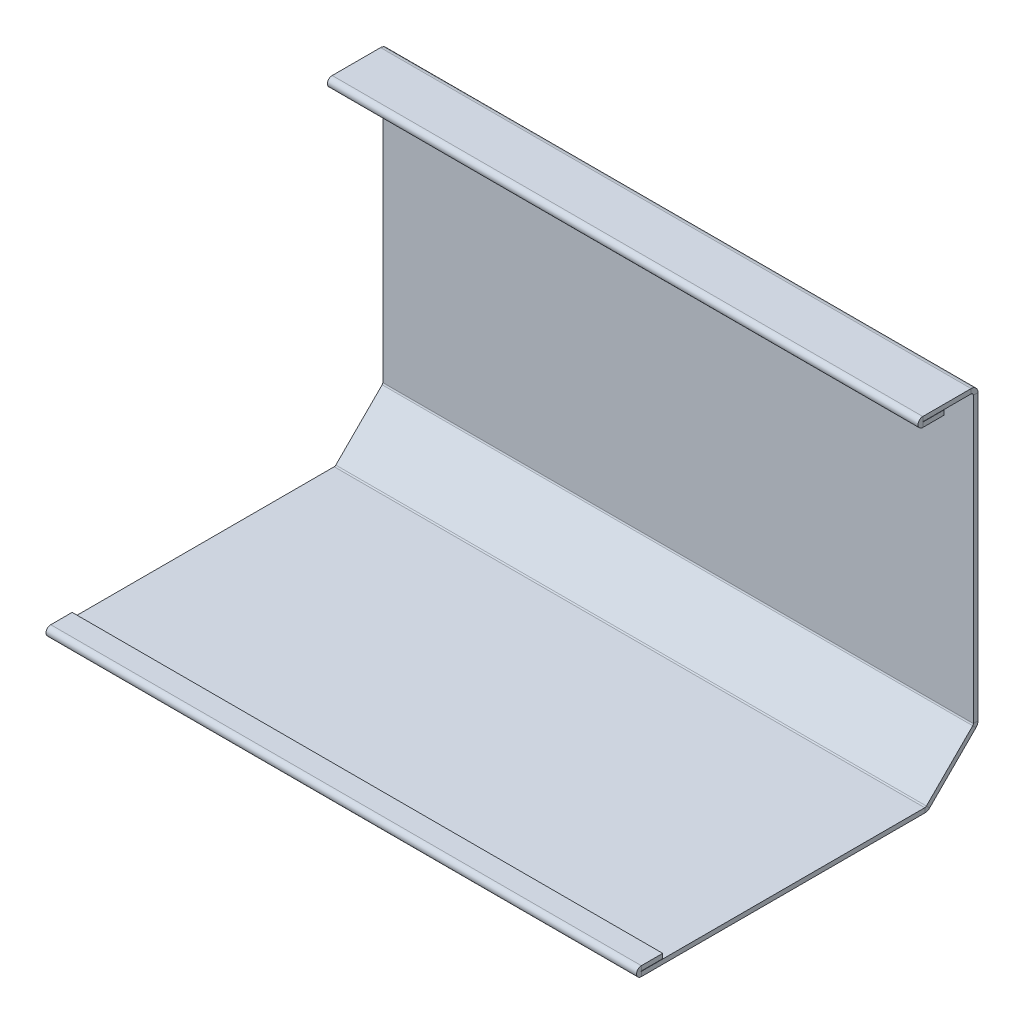
ISO-10303-21;
HEADER;
FILE_DESCRIPTION(('STEP AP214'),'2;1');
FILE_NAME('part.step','',(''),(''),'','','');
FILE_SCHEMA(('AUTOMOTIVE_DESIGN { 1 0 10303 214 1 1 1 1 }'));
ENDSEC;
DATA;
#1=APPLICATION_CONTEXT('core data for automotive mechanical design processes');
#2=APPLICATION_PROTOCOL_DEFINITION('international standard','automotive_design',2000,#1);
#3=PRODUCT_CONTEXT('',#1,'mechanical');
#4=PRODUCT('Part','Part','',(#3));
#5=PRODUCT_RELATED_PRODUCT_CATEGORY('part','',(#4));
#6=PRODUCT_DEFINITION_FORMATION('','',#4);
#7=PRODUCT_DEFINITION_CONTEXT('part definition',#1,'design');
#8=PRODUCT_DEFINITION('design','',#6,#7);
#9=PRODUCT_DEFINITION_SHAPE('','',#8);
#10=(LENGTH_UNIT() NAMED_UNIT(*) SI_UNIT(.MILLI.,.METRE.));
#11=(NAMED_UNIT(*) PLANE_ANGLE_UNIT() SI_UNIT($,.RADIAN.));
#12=(NAMED_UNIT(*) SI_UNIT($,.STERADIAN.) SOLID_ANGLE_UNIT());
#13=UNCERTAINTY_MEASURE_WITH_UNIT(LENGTH_MEASURE(1.E-05),#10,'distance_accuracy_value','');
#14=(GEOMETRIC_REPRESENTATION_CONTEXT(3) GLOBAL_UNCERTAINTY_ASSIGNED_CONTEXT((#13)) GLOBAL_UNIT_ASSIGNED_CONTEXT((#10,
#11,#12)) REPRESENTATION_CONTEXT('',''));
#15=CARTESIAN_POINT('',(0.,0.,0.));
#16=DIRECTION('',(0.,0.,1.));
#17=DIRECTION('',(1.,0.,0.));
#18=AXIS2_PLACEMENT_3D('',#15,#16,#17);
#19=CARTESIAN_POINT('',(-96.,111.97867965644,-64.0000000000011));
#20=DIRECTION('',(1.,0.,0.));
#21=DIRECTION('',(0.,0.,-1.));
#22=AXIS2_PLACEMENT_3D('',#19,#20,#21);
#23=PLANE('',#22);
#24=DIRECTION('',(0.,0.,-1.));
#25=VECTOR('',#24,1.);
#26=CARTESIAN_POINT('',(-96.,109.74207965644,-62.500000000001));
#27=LINE('',#26,#25);
#28=CARTESIAN_POINT('',(-96.,109.74207965644,-62.500000000001));
#29=VERTEX_POINT('',#28);
#30=CARTESIAN_POINT('',(-96.,109.74207965644,-64.000000000001));
#31=VERTEX_POINT('',#30);
#32=EDGE_CURVE('E368',#29,#31,#27,.T.);
#33=ORIENTED_EDGE('',*,*,#32,.T.);
#34=DIRECTION('',(0.,1.,0.));
#35=VECTOR('',#34,1.);
#36=CARTESIAN_POINT('',(-96.,-1.50000000000069,-63.9999999999999));
#37=LINE('',#36,#35);
#38=CARTESIAN_POINT('',(-96.,17.3051097100439,-64.0000000000001));
#39=VERTEX_POINT('',#38);
#40=EDGE_CURVE('E365',#39,#31,#37,.T.);
#41=ORIENTED_EDGE('',*,*,#40,.F.);
#42=DIRECTION('',(0.,0.,1.));
#43=VECTOR('',#42,1.);
#44=CARTESIAN_POINT('',(-96.,17.3051097100439,-62.5000000000001));
#45=LINE('',#44,#43);
#46=CARTESIAN_POINT('',(-96.,17.3051097100439,-62.5000000000001));
#47=VERTEX_POINT('',#46);
#48=EDGE_CURVE('E354',#47,#39,#45,.F.);
#49=ORIENTED_EDGE('',*,*,#48,.F.);
#50=DIRECTION('',(0.,-1.,0.));
#51=VECTOR('',#50,1.);
#52=CARTESIAN_POINT('',(-96.,111.97867965644,-62.5000000000011));
#53=LINE('',#52,#51);
#54=EDGE_CURVE('E360',#47,#29,#53,.F.);
#55=ORIENTED_EDGE('',*,*,#54,.T.);
#56=EDGE_LOOP('',(#33,#41,#49,#55));
#57=FACE_BOUND('',#56,.T.);
#58=ADVANCED_FACE('F77',(#57),#23,.F.);
#59=CARTESIAN_POINT('',(96.,16.9999999999999,-64.0000000000001));
#60=DIRECTION('',(-1.,0.,0.));
#61=DIRECTION('',(0.,0.,1.));
#62=AXIS2_PLACEMENT_3D('',#59,#60,#61);
#63=PLANE('',#62);
#64=DIRECTION('',(0.,0.,-1.));
#65=VECTOR('',#64,1.);
#66=CARTESIAN_POINT('',(95.9999999999999,109.74207965644,-62.500000000001));
#67=LINE('',#66,#65);
#68=CARTESIAN_POINT('',(95.9999999999999,109.74207965644,-62.500000000001));
#69=VERTEX_POINT('',#68);
#70=CARTESIAN_POINT('',(95.9999999999999,109.74207965644,-64.0000000000011));
#71=VERTEX_POINT('',#70);
#72=EDGE_CURVE('E352',#69,#71,#67,.T.);
#73=ORIENTED_EDGE('',*,*,#72,.F.);
#74=DIRECTION('',(0.,1.,0.));
#75=VECTOR('',#74,1.);
#76=CARTESIAN_POINT('',(96.,16.9999999999999,-62.5000000000001));
#77=LINE('',#76,#75);
#78=CARTESIAN_POINT('',(95.9999999999999,17.3051097100439,-62.5000000000001));
#79=VERTEX_POINT('',#78);
#80=EDGE_CURVE('E363',#69,#79,#77,.F.);
#81=ORIENTED_EDGE('',*,*,#80,.T.);
#82=DIRECTION('',(0.,0.,1.));
#83=VECTOR('',#82,1.);
#84=CARTESIAN_POINT('',(96.,17.3051097100439,-64.0000000000001));
#85=LINE('',#84,#83);
#86=CARTESIAN_POINT('',(95.9999999999999,17.3051097100439,-64.0000000000001));
#87=VERTEX_POINT('',#86);
#88=EDGE_CURVE('E348',#79,#87,#85,.F.);
#89=ORIENTED_EDGE('',*,*,#88,.T.);
#90=DIRECTION('',(0.,-1.,0.));
#91=VECTOR('',#90,1.);
#92=CARTESIAN_POINT('',(96.,-1.50000000000069,-63.9999999999999));
#93=LINE('',#92,#91);
#94=EDGE_CURVE('E335',#71,#87,#93,.T.);
#95=ORIENTED_EDGE('',*,*,#94,.F.);
#96=EDGE_LOOP('',(#73,#81,#89,#95));
#97=FACE_BOUND('',#96,.T.);
#98=ADVANCED_FACE('F578',(#97),#63,.F.);
#99=CARTESIAN_POINT('',(0.,-1.50000000000069,-63.9999999999999));
#100=DIRECTION('',(0.,0.,1.));
#101=DIRECTION('',(0.,-1.,0.));
#102=AXIS2_PLACEMENT_3D('',#99,#100,#101);
#103=PLANE('',#102);
#104=DIRECTION('',(-1.,0.,0.));
#105=VECTOR('',#104,1.);
#106=CARTESIAN_POINT('',(-96.,109.74207965644,-64.000000000001));
#107=LINE('',#106,#105);
#108=EDGE_CURVE('E387',#31,#71,#107,.F.);
#109=ORIENTED_EDGE('',*,*,#108,.T.);
#110=ORIENTED_EDGE('',*,*,#94,.T.);
#111=DIRECTION('',(-1.,0.,0.));
#112=VECTOR('',#111,1.);
#113=CARTESIAN_POINT('',(96.,17.3051097100439,-64.0000000000001));
#114=LINE('',#113,#112);
#115=EDGE_CURVE('E357',#39,#87,#114,.F.);
#116=ORIENTED_EDGE('',*,*,#115,.F.);
#117=ORIENTED_EDGE('',*,*,#40,.T.);
#118=EDGE_LOOP('',(#109,#110,#116,#117));
#119=FACE_BOUND('',#118,.T.);
#120=ADVANCED_FACE('F547',(#119),#103,.F.);
#121=CARTESIAN_POINT('',(0.,-1.50000000000067,-62.4999999999999));
#122=DIRECTION('',(0.,0.,1.));
#123=DIRECTION('',(0.,-1.,0.));
#124=AXIS2_PLACEMENT_3D('',#121,#122,#123);
#125=PLANE('',#124);
#126=ORIENTED_EDGE('',*,*,#80,.F.);
#127=DIRECTION('',(-1.,0.,0.));
#128=VECTOR('',#127,1.);
#129=CARTESIAN_POINT('',(-96.,109.74207965644,-62.500000000001));
#130=LINE('',#129,#128);
#131=EDGE_CURVE('E377',#29,#69,#130,.F.);
#132=ORIENTED_EDGE('',*,*,#131,.F.);
#133=ORIENTED_EDGE('',*,*,#54,.F.);
#134=DIRECTION('',(-1.,0.,0.));
#135=VECTOR('',#134,1.);
#136=CARTESIAN_POINT('',(96.,17.3051097100439,-62.5000000000001));
#137=LINE('',#136,#135);
#138=EDGE_CURVE('E351',#79,#47,#137,.T.);
#139=ORIENTED_EDGE('',*,*,#138,.F.);
#140=EDGE_LOOP('',(#126,#132,#133,#139));
#141=FACE_BOUND('',#140,.T.);
#142=ADVANCED_FACE('F613',(#141),#125,.T.);
#143=CARTESIAN_POINT('',(-96.,17.4393398282201,-65.0606601717799));
#144=DIRECTION('',(1.,0.,0.));
#145=DIRECTION('',(0.,0.,-1.));
#146=AXIS2_PLACEMENT_3D('',#143,#144,#145);
#147=PLANE('',#146);
#148=DIRECTION('',(0.,-0.707106781186555,-0.70710678118654));
#149=VECTOR('',#148,1.);
#150=CARTESIAN_POINT('',(-96.,16.7842548550219,-62.2842548550221));
#151=LINE('',#150,#149);
#152=CARTESIAN_POINT('',(-96.,16.7842548550219,-62.2842548550221));
#153=VERTEX_POINT('',#152);
#154=CARTESIAN_POINT('',(-96.,15.7235946832421,-63.3449150268019));
#155=VERTEX_POINT('',#154);
#156=EDGE_CURVE('E325',#153,#155,#151,.T.);
#157=ORIENTED_EDGE('',*,*,#156,.T.);
#158=DIRECTION('',(0.,0.707106781186544,-0.707106781186551));
#159=VECTOR('',#158,1.);
#160=CARTESIAN_POINT('',(-96.,17.4393398282201,-65.0606601717799));
#161=LINE('',#160,#159);
#162=CARTESIAN_POINT('',(-96.,0.655084973198158,-48.2764053167578));
#163=VERTEX_POINT('',#162);
#164=EDGE_CURVE('E307',#163,#155,#161,.T.);
#165=ORIENTED_EDGE('',*,*,#164,.F.);
#166=DIRECTION('',(0.,-0.707106781186551,-0.707106781186544));
#167=VECTOR('',#166,1.);
#168=CARTESIAN_POINT('',(-96.,1.71574514497799,-47.215745144978));
#169=LINE('',#168,#167);
#170=CARTESIAN_POINT('',(-96.,1.71574514497799,-47.215745144978));
#171=VERTEX_POINT('',#170);
#172=EDGE_CURVE('E316',#171,#163,#169,.T.);
#173=ORIENTED_EDGE('',*,*,#172,.F.);
#174=DIRECTION('',(0.,0.707106781186544,-0.707106781186551));
#175=VECTOR('',#174,1.);
#176=CARTESIAN_POINT('',(-96.,18.4999999999999,-64.0000000000001));
#177=LINE('',#176,#175);
#178=EDGE_CURVE('E308',#171,#153,#177,.T.);
#179=ORIENTED_EDGE('',*,*,#178,.T.);
#180=EDGE_LOOP('',(#157,#165,#173,#179));
#181=FACE_BOUND('',#180,.T.);
#182=ADVANCED_FACE('F532',(#181),#147,.F.);
#183=CARTESIAN_POINT('',(96.,0.439339828220171,-48.0606601717798));
#184=DIRECTION('',(-1.,0.,0.));
#185=DIRECTION('',(0.,0.,1.));
#186=AXIS2_PLACEMENT_3D('',#183,#184,#185);
#187=PLANE('',#186);
#188=DIRECTION('',(0.,-0.707106781186555,-0.70710678118654));
#189=VECTOR('',#188,1.);
#190=CARTESIAN_POINT('',(95.9999999999999,16.7842548550219,-62.2842548550221));
#191=LINE('',#190,#189);
#192=CARTESIAN_POINT('',(95.9999999999999,16.7842548550219,-62.2842548550221));
#193=VERTEX_POINT('',#192);
#194=CARTESIAN_POINT('',(95.9999999999999,15.7235946832421,-63.3449150268019));
#195=VERTEX_POINT('',#194);
#196=EDGE_CURVE('E321',#193,#195,#191,.T.);
#197=ORIENTED_EDGE('',*,*,#196,.F.);
#198=DIRECTION('',(0.,-0.707106781186544,0.707106781186551));
#199=VECTOR('',#198,1.);
#200=CARTESIAN_POINT('',(96.,1.5,-47.));
#201=LINE('',#200,#199);
#202=CARTESIAN_POINT('',(96.,1.71574514497799,-47.215745144978));
#203=VERTEX_POINT('',#202);
#204=EDGE_CURVE('E305',#193,#203,#201,.T.);
#205=ORIENTED_EDGE('',*,*,#204,.T.);
#206=DIRECTION('',(0.,-0.707106781186551,-0.707106781186544));
#207=VECTOR('',#206,1.);
#208=CARTESIAN_POINT('',(96.,1.71574514497799,-47.215745144978));
#209=LINE('',#208,#207);
#210=CARTESIAN_POINT('',(96.,0.655084973198159,-48.2764053167578));
#211=VERTEX_POINT('',#210);
#212=EDGE_CURVE('E317',#203,#211,#209,.T.);
#213=ORIENTED_EDGE('',*,*,#212,.T.);
#214=DIRECTION('',(0.,-0.707106781186544,0.707106781186551));
#215=VECTOR('',#214,1.);
#216=CARTESIAN_POINT('',(96.,0.439339828220171,-48.0606601717798));
#217=LINE('',#216,#215);
#218=EDGE_CURVE('E292',#195,#211,#217,.T.);
#219=ORIENTED_EDGE('',*,*,#218,.F.);
#220=EDGE_LOOP('',(#197,#205,#213,#219));
#221=FACE_BOUND('',#220,.T.);
#222=ADVANCED_FACE('F604',(#221),#187,.F.);
#223=CARTESIAN_POINT('',(0.,-23.8106601717798,-23.8106601717796));
#224=DIRECTION('',(0.,0.707106781186551,0.707106781186544));
#225=DIRECTION('',(0.,-0.707106781186544,0.707106781186551));
#226=AXIS2_PLACEMENT_3D('',#223,#224,#225);
#227=PLANE('',#226);
#228=DIRECTION('',(-1.,0.,0.));
#229=VECTOR('',#228,1.);
#230=CARTESIAN_POINT('',(-96.,15.7235946832421,-63.3449150268019));
#231=LINE('',#230,#229);
#232=EDGE_CURVE('E344',#155,#195,#231,.F.);
#233=ORIENTED_EDGE('',*,*,#232,.T.);
#234=ORIENTED_EDGE('',*,*,#218,.T.);
#235=DIRECTION('',(1.,0.,0.));
#236=VECTOR('',#235,1.);
#237=CARTESIAN_POINT('',(0.,0.655084973198158,-48.2764053167578));
#238=LINE('',#237,#236);
#239=EDGE_CURVE('E311',#163,#211,#238,.T.);
#240=ORIENTED_EDGE('',*,*,#239,.F.);
#241=ORIENTED_EDGE('',*,*,#164,.T.);
#242=EDGE_LOOP('',(#233,#234,#240,#241));
#243=FACE_BOUND('',#242,.T.);
#244=ADVANCED_FACE('F530',(#243),#227,.F.);
#245=CARTESIAN_POINT('',(0.,-22.75,-22.7499999999998));
#246=DIRECTION('',(0.,0.707106781186551,0.707106781186544));
#247=DIRECTION('',(0.,-0.707106781186544,0.707106781186551));
#248=AXIS2_PLACEMENT_3D('',#245,#246,#247);
#249=PLANE('',#248);
#250=ORIENTED_EDGE('',*,*,#204,.F.);
#251=DIRECTION('',(-1.,0.,0.));
#252=VECTOR('',#251,1.);
#253=CARTESIAN_POINT('',(-96.,16.7842548550219,-62.2842548550221));
#254=LINE('',#253,#252);
#255=EDGE_CURVE('E334',#153,#193,#254,.F.);
#256=ORIENTED_EDGE('',*,*,#255,.F.);
#257=ORIENTED_EDGE('',*,*,#178,.F.);
#258=DIRECTION('',(-1.,0.,0.));
#259=VECTOR('',#258,1.);
#260=CARTESIAN_POINT('',(96.,1.71574514497799,-47.215745144978));
#261=LINE('',#260,#259);
#262=EDGE_CURVE('E320',#203,#171,#261,.T.);
#263=ORIENTED_EDGE('',*,*,#262,.F.);
#264=EDGE_LOOP('',(#250,#256,#257,#263));
#265=FACE_BOUND('',#264,.T.);
#266=ADVANCED_FACE('F603',(#265),#249,.T.);
#267=CARTESIAN_POINT('',(96.,1.5,47.));
#268=DIRECTION('',(-1.,0.,0.));
#269=DIRECTION('',(0.,0.,1.));
#270=AXIS2_PLACEMENT_3D('',#267,#268,#269);
#271=PLANE('',#270);
#272=DIRECTION('',(0.,0.,-1.));
#273=VECTOR('',#272,1.);
#274=CARTESIAN_POINT('',(96.,1.5,47.));
#275=LINE('',#274,#273);
#276=CARTESIAN_POINT('',(96.,1.5,45.45));
#277=VERTEX_POINT('',#276);
#278=CARTESIAN_POINT('',(96.,1.5,-46.694890289956));
#279=VERTEX_POINT('',#278);
#280=EDGE_CURVE('E86',#277,#279,#275,.T.);
#281=ORIENTED_EDGE('',*,*,#280,.F.);
#282=DIRECTION('',(0.,-1.,0.));
#283=VECTOR('',#282,1.);
#284=CARTESIAN_POINT('',(96.,1.5,45.45));
#285=LINE('',#284,#283);
#286=CARTESIAN_POINT('',(96.,0.,45.45));
#287=VERTEX_POINT('',#286);
#288=EDGE_CURVE('E255',#277,#287,#285,.T.);
#289=ORIENTED_EDGE('',*,*,#288,.T.);
#290=DIRECTION('',(0.,0.,-1.));
#291=VECTOR('',#290,1.);
#292=CARTESIAN_POINT('',(96.,0.,47.));
#293=LINE('',#292,#291);
#294=CARTESIAN_POINT('',(96.,0.,-46.694890289956));
#295=VERTEX_POINT('',#294);
#296=EDGE_CURVE('E271',#287,#295,#293,.T.);
#297=ORIENTED_EDGE('',*,*,#296,.T.);
#298=DIRECTION('',(0.,-1.,0.));
#299=VECTOR('',#298,1.);
#300=CARTESIAN_POINT('',(96.,1.5,-46.694890289956));
#301=LINE('',#300,#299);
#302=EDGE_CURVE('E279',#279,#295,#301,.T.);
#303=ORIENTED_EDGE('',*,*,#302,.F.);
#304=EDGE_LOOP('',(#281,#289,#297,#303));
#305=FACE_BOUND('',#304,.T.);
#306=ADVANCED_FACE('F79',(#305),#271,.F.);
#307=CARTESIAN_POINT('',(-96.,1.5,47.));
#308=DIRECTION('',(1.,0.,0.));
#309=DIRECTION('',(0.,0.,-1.));
#310=AXIS2_PLACEMENT_3D('',#307,#308,#309);
#311=PLANE('',#310);
#312=DIRECTION('',(0.,0.,1.));
#313=VECTOR('',#312,1.);
#314=CARTESIAN_POINT('',(-96.,0.,47.));
#315=LINE('',#314,#313);
#316=CARTESIAN_POINT('',(-96.,0.,-46.694890289956));
#317=VERTEX_POINT('',#316);
#318=CARTESIAN_POINT('',(-96.,0.,45.45));
#319=VERTEX_POINT('',#318);
#320=EDGE_CURVE('E81',#317,#319,#315,.T.);
#321=ORIENTED_EDGE('',*,*,#320,.T.);
#322=DIRECTION('',(0.,-1.,0.));
#323=VECTOR('',#322,1.);
#324=CARTESIAN_POINT('',(-96.,1.5,45.45));
#325=LINE('',#324,#323);
#326=CARTESIAN_POINT('',(-96.,1.5,45.45));
#327=VERTEX_POINT('',#326);
#328=EDGE_CURVE('E244',#327,#319,#325,.T.);
#329=ORIENTED_EDGE('',*,*,#328,.F.);
#330=DIRECTION('',(0.,0.,1.));
#331=VECTOR('',#330,1.);
#332=CARTESIAN_POINT('',(-96.,1.5,47.));
#333=LINE('',#332,#331);
#334=CARTESIAN_POINT('',(-96.,1.5,-46.694890289956));
#335=VERTEX_POINT('',#334);
#336=EDGE_CURVE('E13',#335,#327,#333,.T.);
#337=ORIENTED_EDGE('',*,*,#336,.F.);
#338=DIRECTION('',(0.,-1.,0.));
#339=VECTOR('',#338,1.);
#340=CARTESIAN_POINT('',(-96.,1.5,-46.694890289956));
#341=LINE('',#340,#339);
#342=EDGE_CURVE('E277',#335,#317,#341,.T.);
#343=ORIENTED_EDGE('',*,*,#342,.T.);
#344=EDGE_LOOP('',(#321,#329,#337,#343));
#345=FACE_BOUND('',#344,.T.);
#346=ADVANCED_FACE('F276',(#345),#311,.F.);
#347=CARTESIAN_POINT('',(0.,1.5,0.));
#348=DIRECTION('',(0.,-1.,0.));
#349=DIRECTION('',(0.,0.,-1.));
#350=AXIS2_PLACEMENT_3D('',#347,#348,#349);
#351=PLANE('',#350);
#352=ORIENTED_EDGE('',*,*,#336,.T.);
#353=DIRECTION('',(1.,0.,0.));
#354=VECTOR('',#353,1.);
#355=CARTESIAN_POINT('',(96.,1.5,45.45));
#356=LINE('',#355,#354);
#357=EDGE_CURVE('E496',#277,#327,#356,.F.);
#358=ORIENTED_EDGE('',*,*,#357,.F.);
#359=ORIENTED_EDGE('',*,*,#280,.T.);
#360=DIRECTION('',(-1.,0.,0.));
#361=VECTOR('',#360,1.);
#362=CARTESIAN_POINT('',(-96.,1.5,-46.694890289956));
#363=LINE('',#362,#361);
#364=EDGE_CURVE('E291',#335,#279,#363,.F.);
#365=ORIENTED_EDGE('',*,*,#364,.F.);
#366=EDGE_LOOP('',(#352,#358,#359,#365));
#367=FACE_BOUND('',#366,.T.);
#368=ADVANCED_FACE('F513',(#367),#351,.F.);
#369=CARTESIAN_POINT('',(0.,0.,0.));
#370=DIRECTION('',(0.,-1.,0.));
#371=DIRECTION('',(0.,0.,-1.));
#372=AXIS2_PLACEMENT_3D('',#369,#370,#371);
#373=PLANE('',#372);
#374=DIRECTION('',(1.,0.,0.));
#375=VECTOR('',#374,1.);
#376=CARTESIAN_POINT('',(96.,0.,45.45));
#377=LINE('',#376,#375);
#378=EDGE_CURVE('E262',#287,#319,#377,.F.);
#379=ORIENTED_EDGE('',*,*,#378,.T.);
#380=ORIENTED_EDGE('',*,*,#320,.F.);
#381=DIRECTION('',(-1.,0.,0.));
#382=VECTOR('',#381,1.);
#383=CARTESIAN_POINT('',(-96.,0.,-46.694890289956));
#384=LINE('',#383,#382);
#385=EDGE_CURVE('E301',#317,#295,#384,.F.);
#386=ORIENTED_EDGE('',*,*,#385,.T.);
#387=ORIENTED_EDGE('',*,*,#296,.F.);
#388=EDGE_LOOP('',(#379,#380,#386,#387));
#389=FACE_BOUND('',#388,.T.);
#390=ADVANCED_FACE('F269',(#389),#373,.T.);
#391=CARTESIAN_POINT('',(96.,2.2366,-46.694890289956));
#392=DIRECTION('',(1.,0.,0.));
#393=DIRECTION('',(0.,0.,-1.));
#394=AXIS2_PLACEMENT_3D('',#391,#392,#393);
#395=PLANE('',#394);
#396=ORIENTED_EDGE('',*,*,#212,.F.);
#397=CARTESIAN_POINT('',(96.,2.2366,-46.694890289956));
#398=DIRECTION('',(-1.,0.,0.));
#399=DIRECTION('',(0.,0.,1.));
#400=AXIS2_PLACEMENT_3D('',#397,#398,#399);
#401=CIRCLE('',#400,0.736599999999996);
#402=EDGE_CURVE('E295',#279,#203,#401,.F.);
#403=ORIENTED_EDGE('',*,*,#402,.F.);
#404=ORIENTED_EDGE('',*,*,#302,.T.);
#405=CARTESIAN_POINT('',(96.,2.2366,-46.694890289956));
#406=DIRECTION('',(-1.,0.,0.));
#407=DIRECTION('',(0.,0.,1.));
#408=AXIS2_PLACEMENT_3D('',#405,#406,#407);
#409=CIRCLE('',#408,2.2366);
#410=EDGE_CURVE('E286',#295,#211,#409,.F.);
#411=ORIENTED_EDGE('',*,*,#410,.T.);
#412=EDGE_LOOP('',(#396,#403,#404,#411));
#413=FACE_BOUND('',#412,.T.);
#414=ADVANCED_FACE('F518',(#413),#395,.T.);
#415=CARTESIAN_POINT('',(-96.,2.2366,-46.694890289956));
#416=DIRECTION('',(1.,0.,0.));
#417=DIRECTION('',(0.,0.,-1.));
#418=AXIS2_PLACEMENT_3D('',#415,#416,#417);
#419=PLANE('',#418);
#420=CARTESIAN_POINT('',(-96.,2.2366,-46.694890289956));
#421=DIRECTION('',(-1.,0.,0.));
#422=DIRECTION('',(0.,0.,1.));
#423=AXIS2_PLACEMENT_3D('',#420,#421,#422);
#424=CIRCLE('',#423,0.736599999999996);
#425=EDGE_CURVE('E288',#171,#335,#424,.T.);
#426=ORIENTED_EDGE('',*,*,#425,.F.);
#427=ORIENTED_EDGE('',*,*,#172,.T.);
#428=CARTESIAN_POINT('',(-96.,2.2366,-46.694890289956));
#429=DIRECTION('',(-1.,0.,0.));
#430=DIRECTION('',(0.,0.,1.));
#431=AXIS2_PLACEMENT_3D('',#428,#429,#430);
#432=CIRCLE('',#431,2.2366);
#433=EDGE_CURVE('E298',#163,#317,#432,.T.);
#434=ORIENTED_EDGE('',*,*,#433,.T.);
#435=ORIENTED_EDGE('',*,*,#342,.F.);
#436=EDGE_LOOP('',(#426,#427,#434,#435));
#437=FACE_BOUND('',#436,.T.);
#438=ADVANCED_FACE('F523',(#437),#419,.F.);
#439=CARTESIAN_POINT('',(-96.,2.2366,-46.694890289956));
#440=DIRECTION('',(-1.,0.,0.));
#441=DIRECTION('',(0.,-0.707106781186551,-0.707106781186544));
#442=AXIS2_PLACEMENT_3D('',#439,#440,#441);
#443=CYLINDRICAL_SURFACE('',#442,2.2366);
#444=ORIENTED_EDGE('',*,*,#385,.F.);
#445=ORIENTED_EDGE('',*,*,#433,.F.);
#446=ORIENTED_EDGE('',*,*,#239,.T.);
#447=ORIENTED_EDGE('',*,*,#410,.F.);
#448=EDGE_LOOP('',(#444,#445,#446,#447));
#449=FACE_BOUND('',#448,.T.);
#450=ADVANCED_FACE('F520',(#449),#443,.T.);
#451=CARTESIAN_POINT('',(-96.,2.2366,-46.694890289956));
#452=DIRECTION('',(-1.,0.,0.));
#453=DIRECTION('',(0.,-0.707106781186551,-0.707106781186544));
#454=AXIS2_PLACEMENT_3D('',#451,#452,#453);
#455=CYLINDRICAL_SURFACE('',#454,0.736599999999996);
#456=ORIENTED_EDGE('',*,*,#364,.T.);
#457=ORIENTED_EDGE('',*,*,#402,.T.);
#458=ORIENTED_EDGE('',*,*,#262,.T.);
#459=ORIENTED_EDGE('',*,*,#425,.T.);
#460=EDGE_LOOP('',(#456,#457,#458,#459));
#461=FACE_BOUND('',#460,.T.);
#462=ADVANCED_FACE('F597',(#461),#455,.F.);
#463=CARTESIAN_POINT('',(95.9999999999999,17.3051097100439,-61.7634000000001));
#464=DIRECTION('',(1.,0.,0.));
#465=DIRECTION('',(0.,0.,-1.));
#466=AXIS2_PLACEMENT_3D('',#463,#464,#465);
#467=PLANE('',#466);
#468=ORIENTED_EDGE('',*,*,#88,.F.);
#469=CARTESIAN_POINT('',(95.9999999999999,17.3051097100439,-61.7634000000001));
#470=DIRECTION('',(-1.,0.,0.));
#471=DIRECTION('',(0.,0.,1.));
#472=AXIS2_PLACEMENT_3D('',#469,#470,#471);
#473=CIRCLE('',#472,0.73659999999999);
#474=EDGE_CURVE('E338',#193,#79,#473,.F.);
#475=ORIENTED_EDGE('',*,*,#474,.F.);
#476=ORIENTED_EDGE('',*,*,#196,.T.);
#477=CARTESIAN_POINT('',(95.9999999999999,17.3051097100439,-61.7634000000001));
#478=DIRECTION('',(-1.,0.,0.));
#479=DIRECTION('',(0.,0.,1.));
#480=AXIS2_PLACEMENT_3D('',#477,#478,#479);
#481=CIRCLE('',#480,2.23659999999999);
#482=EDGE_CURVE('E328',#195,#87,#481,.F.);
#483=ORIENTED_EDGE('',*,*,#482,.T.);
#484=EDGE_LOOP('',(#468,#475,#476,#483));
#485=FACE_BOUND('',#484,.T.);
#486=ADVANCED_FACE('F594',(#485),#467,.T.);
#487=CARTESIAN_POINT('',(-96.,17.3051097100439,-61.7634000000001));
#488=DIRECTION('',(1.,0.,0.));
#489=DIRECTION('',(0.,0.,-1.));
#490=AXIS2_PLACEMENT_3D('',#487,#488,#489);
#491=PLANE('',#490);
#492=CARTESIAN_POINT('',(-96.,17.3051097100439,-61.7634000000001));
#493=DIRECTION('',(-1.,0.,0.));
#494=DIRECTION('',(0.,0.,1.));
#495=AXIS2_PLACEMENT_3D('',#492,#493,#494);
#496=CIRCLE('',#495,0.73659999999999);
#497=EDGE_CURVE('E331',#47,#153,#496,.T.);
#498=ORIENTED_EDGE('',*,*,#497,.F.);
#499=ORIENTED_EDGE('',*,*,#48,.T.);
#500=CARTESIAN_POINT('',(-96.,17.3051097100439,-61.7634000000001));
#501=DIRECTION('',(-1.,0.,0.));
#502=DIRECTION('',(0.,0.,1.));
#503=AXIS2_PLACEMENT_3D('',#500,#501,#502);
#504=CIRCLE('',#503,2.23659999999999);
#505=EDGE_CURVE('E341',#39,#155,#504,.T.);
#506=ORIENTED_EDGE('',*,*,#505,.T.);
#507=ORIENTED_EDGE('',*,*,#156,.F.);
#508=EDGE_LOOP('',(#498,#499,#506,#507));
#509=FACE_BOUND('',#508,.T.);
#510=ADVANCED_FACE('F540',(#509),#491,.F.);
#511=CARTESIAN_POINT('',(-96.,17.3051097100439,-61.7634000000001));
#512=DIRECTION('',(-1.,0.,0.));
#513=DIRECTION('',(0.,0.,-1.));
#514=AXIS2_PLACEMENT_3D('',#511,#512,#513);
#515=CYLINDRICAL_SURFACE('',#514,2.23659999999999);
#516=ORIENTED_EDGE('',*,*,#232,.F.);
#517=ORIENTED_EDGE('',*,*,#505,.F.);
#518=ORIENTED_EDGE('',*,*,#115,.T.);
#519=ORIENTED_EDGE('',*,*,#482,.F.);
#520=EDGE_LOOP('',(#516,#517,#518,#519));
#521=FACE_BOUND('',#520,.T.);
#522=ADVANCED_FACE('F539',(#521),#515,.T.);
#523=CARTESIAN_POINT('',(-96.,17.3051097100439,-61.7634000000001));
#524=DIRECTION('',(-1.,0.,0.));
#525=DIRECTION('',(0.,0.,-1.));
#526=AXIS2_PLACEMENT_3D('',#523,#524,#525);
#527=CYLINDRICAL_SURFACE('',#526,0.73659999999999);
#528=ORIENTED_EDGE('',*,*,#255,.T.);
#529=ORIENTED_EDGE('',*,*,#474,.T.);
#530=ORIENTED_EDGE('',*,*,#138,.T.);
#531=ORIENTED_EDGE('',*,*,#497,.T.);
#532=EDGE_LOOP('',(#528,#529,#530,#531));
#533=FACE_BOUND('',#532,.T.);
#534=ADVANCED_FACE('F589',(#533),#527,.F.);
#535=CARTESIAN_POINT('',(95.9999999999999,109.74207965644,-61.763400000001));
#536=DIRECTION('',(1.,0.,0.));
#537=DIRECTION('',(0.,0.,-1.));
#538=AXIS2_PLACEMENT_3D('',#535,#536,#537);
#539=PLANE('',#538);
#540=DIRECTION('',(0.,-1.,0.));
#541=VECTOR('',#540,1.);
#542=CARTESIAN_POINT('',(96.,111.97867965644,-61.7634000000011));
#543=LINE('',#542,#541);
#544=CARTESIAN_POINT('',(95.9999999999999,110.47867965644,-61.763400000001));
#545=VERTEX_POINT('',#544);
#546=CARTESIAN_POINT('',(95.9999999999999,111.97867965644,-61.7634000000011));
#547=VERTEX_POINT('',#546);
#548=EDGE_CURVE('E391',#545,#547,#543,.F.);
#549=ORIENTED_EDGE('',*,*,#548,.F.);
#550=CARTESIAN_POINT('',(95.9999999999999,109.74207965644,-61.763400000001));
#551=DIRECTION('',(-1.,0.,0.));
#552=DIRECTION('',(0.,0.,1.));
#553=AXIS2_PLACEMENT_3D('',#550,#551,#552);
#554=CIRCLE('',#553,0.73659999999999);
#555=EDGE_CURVE('E381',#69,#545,#554,.F.);
#556=ORIENTED_EDGE('',*,*,#555,.F.);
#557=ORIENTED_EDGE('',*,*,#72,.T.);
#558=CARTESIAN_POINT('',(95.9999999999999,109.74207965644,-61.763400000001));
#559=DIRECTION('',(-1.,0.,0.));
#560=DIRECTION('',(0.,0.,1.));
#561=AXIS2_PLACEMENT_3D('',#558,#559,#560);
#562=CIRCLE('',#561,2.23659999999999);
#563=EDGE_CURVE('E371',#71,#547,#562,.F.);
#564=ORIENTED_EDGE('',*,*,#563,.T.);
#565=EDGE_LOOP('',(#549,#556,#557,#564));
#566=FACE_BOUND('',#565,.T.);
#567=ADVANCED_FACE('F592',(#566),#539,.T.);
#568=CARTESIAN_POINT('',(-96.,109.74207965644,-61.763400000001));
#569=DIRECTION('',(1.,0.,0.));
#570=DIRECTION('',(0.,0.,-1.));
#571=AXIS2_PLACEMENT_3D('',#568,#569,#570);
#572=PLANE('',#571);
#573=CARTESIAN_POINT('',(-96.,109.74207965644,-61.763400000001));
#574=DIRECTION('',(-1.,0.,0.));
#575=DIRECTION('',(0.,0.,1.));
#576=AXIS2_PLACEMENT_3D('',#573,#574,#575);
#577=CIRCLE('',#576,0.73659999999999);
#578=CARTESIAN_POINT('',(-96.,110.47867965644,-61.763400000001));
#579=VERTEX_POINT('',#578);
#580=EDGE_CURVE('E374',#579,#29,#577,.T.);
#581=ORIENTED_EDGE('',*,*,#580,.F.);
#582=DIRECTION('',(0.,-1.,0.));
#583=VECTOR('',#582,1.);
#584=CARTESIAN_POINT('',(-96.,110.47867965644,-61.763400000001));
#585=LINE('',#584,#583);
#586=CARTESIAN_POINT('',(-96.,111.97867965644,-61.7634000000011));
#587=VERTEX_POINT('',#586);
#588=EDGE_CURVE('E397',#579,#587,#585,.F.);
#589=ORIENTED_EDGE('',*,*,#588,.T.);
#590=CARTESIAN_POINT('',(-96.,109.74207965644,-61.763400000001));
#591=DIRECTION('',(-1.,0.,0.));
#592=DIRECTION('',(0.,0.,1.));
#593=AXIS2_PLACEMENT_3D('',#590,#591,#592);
#594=CIRCLE('',#593,2.23659999999999);
#595=EDGE_CURVE('E384',#587,#31,#594,.T.);
#596=ORIENTED_EDGE('',*,*,#595,.T.);
#597=ORIENTED_EDGE('',*,*,#32,.F.);
#598=EDGE_LOOP('',(#581,#589,#596,#597));
#599=FACE_BOUND('',#598,.T.);
#600=ADVANCED_FACE('F556',(#599),#572,.F.);
#601=CARTESIAN_POINT('',(-96.,109.74207965644,-61.763400000001));
#602=DIRECTION('',(-1.,0.,0.));
#603=DIRECTION('',(0.,1.,0.));
#604=AXIS2_PLACEMENT_3D('',#601,#602,#603);
#605=CYLINDRICAL_SURFACE('',#604,2.23659999999999);
#606=ORIENTED_EDGE('',*,*,#108,.F.);
#607=ORIENTED_EDGE('',*,*,#595,.F.);
#608=DIRECTION('',(-1.,0.,0.));
#609=VECTOR('',#608,1.);
#610=CARTESIAN_POINT('',(96.,111.97867965644,-61.7634000000011));
#611=LINE('',#610,#609);
#612=EDGE_CURVE('E400',#587,#547,#611,.F.);
#613=ORIENTED_EDGE('',*,*,#612,.T.);
#614=ORIENTED_EDGE('',*,*,#563,.F.);
#615=EDGE_LOOP('',(#606,#607,#613,#614));
#616=FACE_BOUND('',#615,.T.);
#617=ADVANCED_FACE('F555',(#616),#605,.T.);
#618=CARTESIAN_POINT('',(-96.,109.74207965644,-61.763400000001));
#619=DIRECTION('',(-1.,0.,0.));
#620=DIRECTION('',(0.,1.,0.));
#621=AXIS2_PLACEMENT_3D('',#618,#619,#620);
#622=CYLINDRICAL_SURFACE('',#621,0.73659999999999);
#623=ORIENTED_EDGE('',*,*,#131,.T.);
#624=ORIENTED_EDGE('',*,*,#555,.T.);
#625=DIRECTION('',(-1.,0.,0.));
#626=VECTOR('',#625,1.);
#627=CARTESIAN_POINT('',(96.,110.47867965644,-61.763400000001));
#628=LINE('',#627,#626);
#629=EDGE_CURVE('E394',#545,#579,#628,.T.);
#630=ORIENTED_EDGE('',*,*,#629,.T.);
#631=ORIENTED_EDGE('',*,*,#580,.T.);
#632=EDGE_LOOP('',(#623,#624,#630,#631));
#633=FACE_BOUND('',#632,.T.);
#634=ADVANCED_FACE('F566',(#633),#622,.F.);
#635=CARTESIAN_POINT('',(-96.,111.978679656441,-44.5000000000011));
#636=DIRECTION('',(1.,0.,0.));
#637=DIRECTION('',(0.,0.,-1.));
#638=AXIS2_PLACEMENT_3D('',#635,#636,#637);
#639=PLANE('',#638);
#640=DIRECTION('',(0.,0.,-1.));
#641=VECTOR('',#640,1.);
#642=CARTESIAN_POINT('',(-96.,110.478679656441,-44.5000000000011));
#643=LINE('',#642,#641);
#644=CARTESIAN_POINT('',(-96.,110.47867965644,-46.0500000000011));
#645=VERTEX_POINT('',#644);
#646=EDGE_CURVE('E403',#579,#645,#643,.F.);
#647=ORIENTED_EDGE('',*,*,#646,.T.);
#648=DIRECTION('',(0.,1.,0.));
#649=VECTOR('',#648,1.);
#650=CARTESIAN_POINT('',(-96.,110.47867965644,-46.0500000000011));
#651=LINE('',#650,#649);
#652=CARTESIAN_POINT('',(-96.,111.97867965644,-46.0500000000011));
#653=VERTEX_POINT('',#652);
#654=EDGE_CURVE('E102',#645,#653,#651,.T.);
#655=ORIENTED_EDGE('',*,*,#654,.T.);
#656=DIRECTION('',(0.,0.,1.));
#657=VECTOR('',#656,1.);
#658=CARTESIAN_POINT('',(-96.,111.978679656441,-1.55925357727958E-12));
#659=LINE('',#658,#657);
#660=EDGE_CURVE('E407',#587,#653,#659,.T.);
#661=ORIENTED_EDGE('',*,*,#660,.F.);
#662=ORIENTED_EDGE('',*,*,#588,.F.);
#663=EDGE_LOOP('',(#647,#655,#661,#662));
#664=FACE_BOUND('',#663,.T.);
#665=ADVANCED_FACE('F563',(#664),#639,.F.);
#666=CARTESIAN_POINT('',(96.,111.97867965644,-62.5000000000011));
#667=DIRECTION('',(-1.,0.,0.));
#668=DIRECTION('',(0.,0.,1.));
#669=AXIS2_PLACEMENT_3D('',#666,#667,#668);
#670=PLANE('',#669);
#671=DIRECTION('',(0.,0.,-1.));
#672=VECTOR('',#671,1.);
#673=CARTESIAN_POINT('',(96.,111.978679656441,-1.55925357727958E-12));
#674=LINE('',#673,#672);
#675=CARTESIAN_POINT('',(96.,111.97867965644,-46.0500000000011));
#676=VERTEX_POINT('',#675);
#677=EDGE_CURVE('E378',#676,#547,#674,.T.);
#678=ORIENTED_EDGE('',*,*,#677,.F.);
#679=DIRECTION('',(0.,1.,0.));
#680=VECTOR('',#679,1.);
#681=CARTESIAN_POINT('',(96.,110.47867965644,-46.0500000000011));
#682=LINE('',#681,#680);
#683=CARTESIAN_POINT('',(96.,110.47867965644,-46.0500000000011));
#684=VERTEX_POINT('',#683);
#685=EDGE_CURVE('E424',#684,#676,#682,.T.);
#686=ORIENTED_EDGE('',*,*,#685,.F.);
#687=DIRECTION('',(0.,0.,1.));
#688=VECTOR('',#687,1.);
#689=CARTESIAN_POINT('',(96.,110.47867965644,-62.5000000000011));
#690=LINE('',#689,#688);
#691=EDGE_CURVE('E405',#684,#545,#690,.F.);
#692=ORIENTED_EDGE('',*,*,#691,.T.);
#693=ORIENTED_EDGE('',*,*,#548,.T.);
#694=EDGE_LOOP('',(#678,#686,#692,#693));
#695=FACE_BOUND('',#694,.T.);
#696=ADVANCED_FACE('F565',(#695),#670,.F.);
#697=CARTESIAN_POINT('',(0.,111.978679656441,-1.55925357727958E-12));
#698=DIRECTION('',(0.,-1.,0.));
#699=DIRECTION('',(0.,0.,-1.));
#700=AXIS2_PLACEMENT_3D('',#697,#698,#699);
#701=PLANE('',#700);
#702=ORIENTED_EDGE('',*,*,#660,.T.);
#703=DIRECTION('',(-1.,0.,0.));
#704=VECTOR('',#703,1.);
#705=CARTESIAN_POINT('',(-96.,111.97867965644,-46.0500000000011));
#706=LINE('',#705,#704);
#707=EDGE_CURVE('E460',#653,#676,#706,.F.);
#708=ORIENTED_EDGE('',*,*,#707,.T.);
#709=ORIENTED_EDGE('',*,*,#677,.T.);
#710=ORIENTED_EDGE('',*,*,#612,.F.);
#711=EDGE_LOOP('',(#702,#708,#709,#710));
#712=FACE_BOUND('',#711,.T.);
#713=ADVANCED_FACE('F561',(#712),#701,.F.);
#714=CARTESIAN_POINT('',(0.,110.478679656441,-1.53823596025356E-12));
#715=DIRECTION('',(0.,-1.,0.));
#716=DIRECTION('',(0.,0.,-1.));
#717=AXIS2_PLACEMENT_3D('',#714,#715,#716);
#718=PLANE('',#717);
#719=DIRECTION('',(-1.,0.,0.));
#720=VECTOR('',#719,1.);
#721=CARTESIAN_POINT('',(-96.,110.47867965644,-46.0500000000011));
#722=LINE('',#721,#720);
#723=EDGE_CURVE('E450',#645,#684,#722,.F.);
#724=ORIENTED_EDGE('',*,*,#723,.F.);
#725=ORIENTED_EDGE('',*,*,#646,.F.);
#726=ORIENTED_EDGE('',*,*,#629,.F.);
#727=ORIENTED_EDGE('',*,*,#691,.F.);
#728=EDGE_LOOP('',(#724,#725,#726,#727));
#729=FACE_BOUND('',#728,.T.);
#730=ADVANCED_FACE('F840',(#729),#718,.T.);
#731=CARTESIAN_POINT('',(-96.,108.87867965644,-49.525000000001));
#732=DIRECTION('',(1.,0.,0.));
#733=DIRECTION('',(0.,0.,1.));
#734=AXIS2_PLACEMENT_3D('',#731,#732,#733);
#735=PLANE('',#734);
#736=DIRECTION('',(0.,-1.,0.));
#737=VECTOR('',#736,1.);
#738=CARTESIAN_POINT('',(-96.,108.87867965644,-46.050000000001));
#739=LINE('',#738,#737);
#740=CARTESIAN_POINT('',(-96.,110.37867965644,-46.0500000000011));
#741=VERTEX_POINT('',#740);
#742=CARTESIAN_POINT('',(-96.,108.87867965644,-46.050000000001));
#743=VERTEX_POINT('',#742);
#744=EDGE_CURVE('E416',#741,#743,#739,.T.);
#745=ORIENTED_EDGE('',*,*,#744,.F.);
#746=DIRECTION('',(0.,0.,-1.));
#747=VECTOR('',#746,1.);
#748=CARTESIAN_POINT('',(-96.,110.37867965644,-49.5250000000011));
#749=LINE('',#748,#747);
#750=CARTESIAN_POINT('',(-96.,110.37867965644,-53.0000000000011));
#751=VERTEX_POINT('',#750);
#752=EDGE_CURVE('E426',#751,#741,#749,.F.);
#753=ORIENTED_EDGE('',*,*,#752,.F.);
#754=DIRECTION('',(0.,-1.,0.));
#755=VECTOR('',#754,1.);
#756=CARTESIAN_POINT('',(-96.,108.87867965644,-53.000000000001));
#757=LINE('',#756,#755);
#758=CARTESIAN_POINT('',(-96.,108.87867965644,-53.000000000001));
#759=VERTEX_POINT('',#758);
#760=EDGE_CURVE('E412',#751,#759,#757,.T.);
#761=ORIENTED_EDGE('',*,*,#760,.T.);
#762=DIRECTION('',(0.,0.,1.));
#763=VECTOR('',#762,1.);
#764=CARTESIAN_POINT('',(-96.,108.87867965644,-49.525000000001));
#765=LINE('',#764,#763);
#766=EDGE_CURVE('E438',#759,#743,#765,.T.);
#767=ORIENTED_EDGE('',*,*,#766,.T.);
#768=EDGE_LOOP('',(#745,#753,#761,#767));
#769=FACE_BOUND('',#768,.T.);
#770=ADVANCED_FACE('F850',(#769),#735,.F.);
#771=CARTESIAN_POINT('',(0.,108.87867965644,-53.000000000001));
#772=DIRECTION('',(0.,0.,1.));
#773=DIRECTION('',(-1.,0.,0.));
#774=AXIS2_PLACEMENT_3D('',#771,#772,#773);
#775=PLANE('',#774);
#776=ORIENTED_EDGE('',*,*,#760,.F.);
#777=DIRECTION('',(1.,0.,0.));
#778=VECTOR('',#777,1.);
#779=CARTESIAN_POINT('',(0.,110.37867965644,-53.0000000000011));
#780=LINE('',#779,#778);
#781=CARTESIAN_POINT('',(96.,110.37867965644,-53.0000000000011));
#782=VERTEX_POINT('',#781);
#783=EDGE_CURVE('E429',#782,#751,#780,.F.);
#784=ORIENTED_EDGE('',*,*,#783,.F.);
#785=DIRECTION('',(0.,-1.,0.));
#786=VECTOR('',#785,1.);
#787=CARTESIAN_POINT('',(96.,108.87867965644,-53.000000000001));
#788=LINE('',#787,#786);
#789=CARTESIAN_POINT('',(96.,108.87867965644,-53.000000000001));
#790=VERTEX_POINT('',#789);
#791=EDGE_CURVE('E410',#782,#790,#788,.T.);
#792=ORIENTED_EDGE('',*,*,#791,.T.);
#793=DIRECTION('',(-1.,0.,0.));
#794=VECTOR('',#793,1.);
#795=CARTESIAN_POINT('',(0.,108.87867965644,-53.000000000001));
#796=LINE('',#795,#794);
#797=EDGE_CURVE('E413',#790,#759,#796,.T.);
#798=ORIENTED_EDGE('',*,*,#797,.T.);
#799=EDGE_LOOP('',(#776,#784,#792,#798));
#800=FACE_BOUND('',#799,.T.);
#801=ADVANCED_FACE('F861',(#800),#775,.F.);
#802=CARTESIAN_POINT('',(96.,108.87867965644,-49.525000000001));
#803=DIRECTION('',(-1.,0.,0.));
#804=DIRECTION('',(0.,0.,-1.));
#805=AXIS2_PLACEMENT_3D('',#802,#803,#804);
#806=PLANE('',#805);
#807=DIRECTION('',(0.,0.,-1.));
#808=VECTOR('',#807,1.);
#809=CARTESIAN_POINT('',(96.,110.37867965644,-49.5250000000011));
#810=LINE('',#809,#808);
#811=CARTESIAN_POINT('',(96.,110.37867965644,-46.0500000000011));
#812=VERTEX_POINT('',#811);
#813=EDGE_CURVE('E420',#812,#782,#810,.T.);
#814=ORIENTED_EDGE('',*,*,#813,.F.);
#815=DIRECTION('',(0.,-1.,0.));
#816=VECTOR('',#815,1.);
#817=CARTESIAN_POINT('',(96.,108.87867965644,-46.050000000001));
#818=LINE('',#817,#816);
#819=CARTESIAN_POINT('',(96.,108.87867965644,-46.0500000000011));
#820=VERTEX_POINT('',#819);
#821=EDGE_CURVE('E395',#812,#820,#818,.T.);
#822=ORIENTED_EDGE('',*,*,#821,.T.);
#823=DIRECTION('',(0.,0.,-1.));
#824=VECTOR('',#823,1.);
#825=CARTESIAN_POINT('',(96.,108.87867965644,-49.525000000001));
#826=LINE('',#825,#824);
#827=EDGE_CURVE('E432',#820,#790,#826,.T.);
#828=ORIENTED_EDGE('',*,*,#827,.T.);
#829=ORIENTED_EDGE('',*,*,#791,.F.);
#830=EDGE_LOOP('',(#814,#822,#828,#829));
#831=FACE_BOUND('',#830,.T.);
#832=ADVANCED_FACE('F872',(#831),#806,.F.);
#833=CARTESIAN_POINT('',(0.,108.87867965644,-49.525000000001));
#834=DIRECTION('',(0.,-1.,0.));
#835=DIRECTION('',(0.,0.,-1.));
#836=AXIS2_PLACEMENT_3D('',#833,#834,#835);
#837=PLANE('',#836);
#838=ORIENTED_EDGE('',*,*,#797,.F.);
#839=ORIENTED_EDGE('',*,*,#827,.F.);
#840=DIRECTION('',(1.,0.,0.));
#841=VECTOR('',#840,1.);
#842=CARTESIAN_POINT('',(0.,108.87867965644,-46.050000000001));
#843=LINE('',#842,#841);
#844=EDGE_CURVE('E435',#743,#820,#843,.T.);
#845=ORIENTED_EDGE('',*,*,#844,.F.);
#846=ORIENTED_EDGE('',*,*,#766,.F.);
#847=EDGE_LOOP('',(#838,#839,#845,#846));
#848=FACE_BOUND('',#847,.T.);
#849=ADVANCED_FACE('F883',(#848),#837,.T.);
#850=CARTESIAN_POINT('',(0.,110.37867965644,-49.5250000000011));
#851=DIRECTION('',(0.,-1.,0.));
#852=DIRECTION('',(0.,0.,-1.));
#853=AXIS2_PLACEMENT_3D('',#850,#851,#852);
#854=PLANE('',#853);
#855=ORIENTED_EDGE('',*,*,#783,.T.);
#856=ORIENTED_EDGE('',*,*,#752,.T.);
#857=DIRECTION('',(1.,0.,0.));
#858=VECTOR('',#857,1.);
#859=CARTESIAN_POINT('',(0.,110.37867965644,-46.0500000000011));
#860=LINE('',#859,#858);
#861=EDGE_CURVE('E423',#741,#812,#860,.T.);
#862=ORIENTED_EDGE('',*,*,#861,.T.);
#863=ORIENTED_EDGE('',*,*,#813,.T.);
#864=EDGE_LOOP('',(#855,#856,#862,#863));
#865=FACE_BOUND('',#864,.T.);
#866=ADVANCED_FACE('F894',(#865),#854,.F.);
#867=CARTESIAN_POINT('',(96.,110.42867965644,-46.0500000000011));
#868=DIRECTION('',(1.,0.,0.));
#869=DIRECTION('',(0.,0.,-1.));
#870=AXIS2_PLACEMENT_3D('',#867,#868,#869);
#871=PLANE('',#870);
#872=ORIENTED_EDGE('',*,*,#821,.F.);
#873=CARTESIAN_POINT('',(96.,110.42867965644,-46.0500000000011));
#874=DIRECTION('',(-1.,0.,0.));
#875=DIRECTION('',(0.,0.,1.));
#876=AXIS2_PLACEMENT_3D('',#873,#874,#875);
#877=CIRCLE('',#876,0.0499999999999945);
#878=EDGE_CURVE('E454',#684,#812,#877,.F.);
#879=ORIENTED_EDGE('',*,*,#878,.F.);
#880=ORIENTED_EDGE('',*,*,#685,.T.);
#881=CARTESIAN_POINT('',(96.,110.42867965644,-46.0500000000011));
#882=DIRECTION('',(-1.,0.,0.));
#883=DIRECTION('',(0.,0.,1.));
#884=AXIS2_PLACEMENT_3D('',#881,#882,#883);
#885=CIRCLE('',#884,1.54999999999999);
#886=EDGE_CURVE('E444',#676,#820,#885,.F.);
#887=ORIENTED_EDGE('',*,*,#886,.T.);
#888=EDGE_LOOP('',(#872,#879,#880,#887));
#889=FACE_BOUND('',#888,.T.);
#890=ADVANCED_FACE('F905',(#889),#871,.T.);
#891=CARTESIAN_POINT('',(-96.,110.42867965644,-46.0500000000011));
#892=DIRECTION('',(1.,0.,0.));
#893=DIRECTION('',(0.,0.,-1.));
#894=AXIS2_PLACEMENT_3D('',#891,#892,#893);
#895=PLANE('',#894);
#896=CARTESIAN_POINT('',(-96.,110.42867965644,-46.0500000000011));
#897=DIRECTION('',(-1.,0.,0.));
#898=DIRECTION('',(0.,0.,1.));
#899=AXIS2_PLACEMENT_3D('',#896,#897,#898);
#900=CIRCLE('',#899,0.0499999999999945);
#901=EDGE_CURVE('E447',#741,#645,#900,.T.);
#902=ORIENTED_EDGE('',*,*,#901,.F.);
#903=ORIENTED_EDGE('',*,*,#744,.T.);
#904=CARTESIAN_POINT('',(-96.,110.42867965644,-46.0500000000011));
#905=DIRECTION('',(-1.,0.,0.));
#906=DIRECTION('',(0.,0.,1.));
#907=AXIS2_PLACEMENT_3D('',#904,#905,#906);
#908=CIRCLE('',#907,1.54999999999999);
#909=EDGE_CURVE('E457',#743,#653,#908,.T.);
#910=ORIENTED_EDGE('',*,*,#909,.T.);
#911=ORIENTED_EDGE('',*,*,#654,.F.);
#912=EDGE_LOOP('',(#902,#903,#910,#911));
#913=FACE_BOUND('',#912,.T.);
#914=ADVANCED_FACE('F916',(#913),#895,.F.);
#915=CARTESIAN_POINT('',(-96.,110.42867965644,-46.0500000000011));
#916=DIRECTION('',(-1.,0.,0.));
#917=DIRECTION('',(0.,-1.,0.));
#918=AXIS2_PLACEMENT_3D('',#915,#916,#917);
#919=CYLINDRICAL_SURFACE('',#918,1.54999999999999);
#920=ORIENTED_EDGE('',*,*,#707,.F.);
#921=ORIENTED_EDGE('',*,*,#909,.F.);
#922=ORIENTED_EDGE('',*,*,#844,.T.);
#923=ORIENTED_EDGE('',*,*,#886,.F.);
#924=EDGE_LOOP('',(#920,#921,#922,#923));
#925=FACE_BOUND('',#924,.T.);
#926=ADVANCED_FACE('F927',(#925),#919,.T.);
#927=CARTESIAN_POINT('',(-96.,110.42867965644,-46.0500000000011));
#928=DIRECTION('',(-1.,0.,0.));
#929=DIRECTION('',(0.,-1.,0.));
#930=AXIS2_PLACEMENT_3D('',#927,#928,#929);
#931=CYLINDRICAL_SURFACE('',#930,0.0499999999999945);
#932=ORIENTED_EDGE('',*,*,#723,.T.);
#933=ORIENTED_EDGE('',*,*,#878,.T.);
#934=ORIENTED_EDGE('',*,*,#861,.F.);
#935=ORIENTED_EDGE('',*,*,#901,.T.);
#936=EDGE_LOOP('',(#932,#933,#934,#935));
#937=FACE_BOUND('',#936,.T.);
#938=ADVANCED_FACE('F938',(#937),#931,.F.);
#939=CARTESIAN_POINT('',(96.,3.1,41.975));
#940=DIRECTION('',(-1.,0.,0.));
#941=DIRECTION('',(0.,0.,1.));
#942=AXIS2_PLACEMENT_3D('',#939,#940,#941);
#943=PLANE('',#942);
#944=DIRECTION('',(0.,1.,0.));
#945=VECTOR('',#944,1.);
#946=CARTESIAN_POINT('',(96.,3.1,45.45));
#947=LINE('',#946,#945);
#948=CARTESIAN_POINT('',(96.,1.6,45.45));
#949=VERTEX_POINT('',#948);
#950=CARTESIAN_POINT('',(96.,3.1,45.45));
#951=VERTEX_POINT('',#950);
#952=EDGE_CURVE('E471',#949,#951,#947,.T.);
#953=ORIENTED_EDGE('',*,*,#952,.F.);
#954=DIRECTION('',(0.,0.,1.));
#955=VECTOR('',#954,1.);
#956=CARTESIAN_POINT('',(96.,1.6,41.975));
#957=LINE('',#956,#955);
#958=CARTESIAN_POINT('',(96.,1.6,38.5));
#959=VERTEX_POINT('',#958);
#960=EDGE_CURVE('E479',#959,#949,#957,.T.);
#961=ORIENTED_EDGE('',*,*,#960,.F.);
#962=DIRECTION('',(0.,1.,0.));
#963=VECTOR('',#962,1.);
#964=CARTESIAN_POINT('',(96.,3.1,38.5));
#965=LINE('',#964,#963);
#966=CARTESIAN_POINT('',(96.,3.1,38.5));
#967=VERTEX_POINT('',#966);
#968=EDGE_CURVE('E467',#959,#967,#965,.T.);
#969=ORIENTED_EDGE('',*,*,#968,.T.);
#970=DIRECTION('',(0.,0.,1.));
#971=VECTOR('',#970,1.);
#972=CARTESIAN_POINT('',(96.,3.1,41.975));
#973=LINE('',#972,#971);
#974=EDGE_CURVE('E489',#967,#951,#973,.T.);
#975=ORIENTED_EDGE('',*,*,#974,.T.);
#976=EDGE_LOOP('',(#953,#961,#969,#975));
#977=FACE_BOUND('',#976,.T.);
#978=ADVANCED_FACE('F504',(#977),#943,.F.);
#979=CARTESIAN_POINT('',(0.,3.1,38.5));
#980=DIRECTION('',(0.,0.,1.));
#981=DIRECTION('',(1.,0.,0.));
#982=AXIS2_PLACEMENT_3D('',#979,#980,#981);
#983=PLANE('',#982);
#984=ORIENTED_EDGE('',*,*,#968,.F.);
#985=DIRECTION('',(1.,0.,0.));
#986=VECTOR('',#985,1.);
#987=CARTESIAN_POINT('',(0.,1.6,38.5));
#988=LINE('',#987,#986);
#989=CARTESIAN_POINT('',(-96.,1.6,38.5));
#990=VERTEX_POINT('',#989);
#991=EDGE_CURVE('E482',#990,#959,#988,.T.);
#992=ORIENTED_EDGE('',*,*,#991,.F.);
#993=DIRECTION('',(0.,1.,0.));
#994=VECTOR('',#993,1.);
#995=CARTESIAN_POINT('',(-96.,3.1,38.5));
#996=LINE('',#995,#994);
#997=CARTESIAN_POINT('',(-96.,3.1,38.5));
#998=VERTEX_POINT('',#997);
#999=EDGE_CURVE('E465',#990,#998,#996,.T.);
#1000=ORIENTED_EDGE('',*,*,#999,.T.);
#1001=DIRECTION('',(1.,0.,0.));
#1002=VECTOR('',#1001,1.);
#1003=CARTESIAN_POINT('',(0.,3.1,38.5));
#1004=LINE('',#1003,#1002);
#1005=EDGE_CURVE('E468',#998,#967,#1004,.T.);
#1006=ORIENTED_EDGE('',*,*,#1005,.T.);
#1007=EDGE_LOOP('',(#984,#992,#1000,#1006));
#1008=FACE_BOUND('',#1007,.T.);
#1009=ADVANCED_FACE('F957',(#1008),#983,.F.);
#1010=CARTESIAN_POINT('',(-96.,3.1,41.975));
#1011=DIRECTION('',(1.,0.,0.));
#1012=DIRECTION('',(0.,0.,-1.));
#1013=AXIS2_PLACEMENT_3D('',#1010,#1011,#1012);
#1014=PLANE('',#1013);
#1015=DIRECTION('',(0.,0.,1.));
#1016=VECTOR('',#1015,1.);
#1017=CARTESIAN_POINT('',(-96.,1.6,41.975));
#1018=LINE('',#1017,#1016);
#1019=CARTESIAN_POINT('',(-96.,1.6,45.45));
#1020=VERTEX_POINT('',#1019);
#1021=EDGE_CURVE('E254',#1020,#990,#1018,.F.);
#1022=ORIENTED_EDGE('',*,*,#1021,.F.);
#1023=DIRECTION('',(0.,1.,0.));
#1024=VECTOR('',#1023,1.);
#1025=CARTESIAN_POINT('',(-96.,3.1,45.45));
#1026=LINE('',#1025,#1024);
#1027=CARTESIAN_POINT('',(-96.,3.1,45.45));
#1028=VERTEX_POINT('',#1027);
#1029=EDGE_CURVE('E451',#1020,#1028,#1026,.T.);
#1030=ORIENTED_EDGE('',*,*,#1029,.T.);
#1031=DIRECTION('',(0.,0.,-1.));
#1032=VECTOR('',#1031,1.);
#1033=CARTESIAN_POINT('',(-96.,3.1,41.975));
#1034=LINE('',#1033,#1032);
#1035=EDGE_CURVE('E485',#1028,#998,#1034,.T.);
#1036=ORIENTED_EDGE('',*,*,#1035,.T.);
#1037=ORIENTED_EDGE('',*,*,#999,.F.);
#1038=EDGE_LOOP('',(#1022,#1030,#1036,#1037));
#1039=FACE_BOUND('',#1038,.T.);
#1040=ADVANCED_FACE('F967',(#1039),#1014,.F.);
#1041=CARTESIAN_POINT('',(0.,3.1,41.975));
#1042=DIRECTION('',(0.,1.,0.));
#1043=DIRECTION('',(0.,0.,1.));
#1044=AXIS2_PLACEMENT_3D('',#1041,#1042,#1043);
#1045=PLANE('',#1044);
#1046=ORIENTED_EDGE('',*,*,#1005,.F.);
#1047=ORIENTED_EDGE('',*,*,#1035,.F.);
#1048=DIRECTION('',(-1.,0.,0.));
#1049=VECTOR('',#1048,1.);
#1050=CARTESIAN_POINT('',(0.,3.1,45.45));
#1051=LINE('',#1050,#1049);
#1052=EDGE_CURVE('E264',#951,#1028,#1051,.T.);
#1053=ORIENTED_EDGE('',*,*,#1052,.F.);
#1054=ORIENTED_EDGE('',*,*,#974,.F.);
#1055=EDGE_LOOP('',(#1046,#1047,#1053,#1054));
#1056=FACE_BOUND('',#1055,.T.);
#1057=ADVANCED_FACE('F978',(#1056),#1045,.T.);
#1058=CARTESIAN_POINT('',(0.,1.6,41.975));
#1059=DIRECTION('',(0.,1.,0.));
#1060=DIRECTION('',(0.,0.,1.));
#1061=AXIS2_PLACEMENT_3D('',#1058,#1059,#1060);
#1062=PLANE('',#1061);
#1063=ORIENTED_EDGE('',*,*,#991,.T.);
#1064=ORIENTED_EDGE('',*,*,#960,.T.);
#1065=DIRECTION('',(1.,0.,0.));
#1066=VECTOR('',#1065,1.);
#1067=CARTESIAN_POINT('',(0.,1.6,45.45));
#1068=LINE('',#1067,#1066);
#1069=EDGE_CURVE('E477',#949,#1020,#1068,.F.);
#1070=ORIENTED_EDGE('',*,*,#1069,.T.);
#1071=ORIENTED_EDGE('',*,*,#1021,.T.);
#1072=EDGE_LOOP('',(#1063,#1064,#1070,#1071));
#1073=FACE_BOUND('',#1072,.T.);
#1074=ADVANCED_FACE('F507',(#1073),#1062,.F.);
#1075=CARTESIAN_POINT('',(-96.,1.55,45.45));
#1076=DIRECTION('',(-1.,0.,0.));
#1077=DIRECTION('',(0.,0.,1.));
#1078=AXIS2_PLACEMENT_3D('',#1075,#1076,#1077);
#1079=PLANE('',#1078);
#1080=ORIENTED_EDGE('',*,*,#1029,.F.);
#1081=CARTESIAN_POINT('',(-96.,1.55,45.45));
#1082=DIRECTION('',(1.,0.,0.));
#1083=DIRECTION('',(0.,0.,-1.));
#1084=AXIS2_PLACEMENT_3D('',#1081,#1082,#1083);
#1085=CIRCLE('',#1084,0.0500000000000001);
#1086=EDGE_CURVE('E250',#327,#1020,#1085,.F.);
#1087=ORIENTED_EDGE('',*,*,#1086,.F.);
#1088=ORIENTED_EDGE('',*,*,#328,.T.);
#1089=CARTESIAN_POINT('',(-96.,1.55,45.45));
#1090=DIRECTION('',(1.,0.,0.));
#1091=DIRECTION('',(0.,0.,-1.));
#1092=AXIS2_PLACEMENT_3D('',#1089,#1090,#1091);
#1093=CIRCLE('',#1092,1.55);
#1094=EDGE_CURVE('E248',#319,#1028,#1093,.F.);
#1095=ORIENTED_EDGE('',*,*,#1094,.T.);
#1096=EDGE_LOOP('',(#1080,#1087,#1088,#1095));
#1097=FACE_BOUND('',#1096,.T.);
#1098=ADVANCED_FACE('F247',(#1097),#1079,.T.);
#1099=CARTESIAN_POINT('',(96.,1.55,45.45));
#1100=DIRECTION('',(-1.,0.,0.));
#1101=DIRECTION('',(0.,0.,1.));
#1102=AXIS2_PLACEMENT_3D('',#1099,#1100,#1101);
#1103=PLANE('',#1102);
#1104=CARTESIAN_POINT('',(96.,1.55,45.45));
#1105=DIRECTION('',(1.,0.,0.));
#1106=DIRECTION('',(0.,0.,-1.));
#1107=AXIS2_PLACEMENT_3D('',#1104,#1105,#1106);
#1108=CIRCLE('',#1107,0.0500000000000001);
#1109=EDGE_CURVE('E94',#949,#277,#1108,.T.);
#1110=ORIENTED_EDGE('',*,*,#1109,.F.);
#1111=ORIENTED_EDGE('',*,*,#952,.T.);
#1112=CARTESIAN_POINT('',(96.,1.55,45.45));
#1113=DIRECTION('',(1.,0.,0.));
#1114=DIRECTION('',(0.,0.,-1.));
#1115=AXIS2_PLACEMENT_3D('',#1112,#1113,#1114);
#1116=CIRCLE('',#1115,1.55);
#1117=EDGE_CURVE('E273',#951,#287,#1116,.T.);
#1118=ORIENTED_EDGE('',*,*,#1117,.T.);
#1119=ORIENTED_EDGE('',*,*,#288,.F.);
#1120=EDGE_LOOP('',(#1110,#1111,#1118,#1119));
#1121=FACE_BOUND('',#1120,.T.);
#1122=ADVANCED_FACE('F500',(#1121),#1103,.F.);
#1123=CARTESIAN_POINT('',(96.,1.55,45.45));
#1124=DIRECTION('',(1.,0.,0.));
#1125=DIRECTION('',(0.,1.,0.));
#1126=AXIS2_PLACEMENT_3D('',#1123,#1124,#1125);
#1127=CYLINDRICAL_SURFACE('',#1126,1.55);
#1128=ORIENTED_EDGE('',*,*,#378,.F.);
#1129=ORIENTED_EDGE('',*,*,#1117,.F.);
#1130=ORIENTED_EDGE('',*,*,#1052,.T.);
#1131=ORIENTED_EDGE('',*,*,#1094,.F.);
#1132=EDGE_LOOP('',(#1128,#1129,#1130,#1131));
#1133=FACE_BOUND('',#1132,.T.);
#1134=ADVANCED_FACE('F260',(#1133),#1127,.T.);
#1135=CARTESIAN_POINT('',(96.,1.55,45.45));
#1136=DIRECTION('',(1.,0.,0.));
#1137=DIRECTION('',(0.,1.,0.));
#1138=AXIS2_PLACEMENT_3D('',#1135,#1136,#1137);
#1139=CYLINDRICAL_SURFACE('',#1138,0.0500000000000001);
#1140=ORIENTED_EDGE('',*,*,#357,.T.);
#1141=ORIENTED_EDGE('',*,*,#1086,.T.);
#1142=ORIENTED_EDGE('',*,*,#1069,.F.);
#1143=ORIENTED_EDGE('',*,*,#1109,.T.);
#1144=EDGE_LOOP('',(#1140,#1141,#1142,#1143));
#1145=FACE_BOUND('',#1144,.T.);
#1146=ADVANCED_FACE('F510',(#1145),#1139,.F.);
#1147=CLOSED_SHELL('',(#58,#98,#120,#142,#182,#222,#244,#266,#306,#346,#368,#390,#414,#438,#450,
#462,#486,#510,#522,#534,#567,#600,#617,#634,#665,#696,#713,#730,#770,#801,#832,#849,#866,#890,
#914,#926,#938,#978,#1009,#1040,#1057,#1074,#1098,#1122,#1134,#1146));
#1148=MANIFOLD_SOLID_BREP('B2',#1147);
#1149=ADVANCED_BREP_SHAPE_REPRESENTATION('',(#18,#1148),#14);
#1150=SHAPE_DEFINITION_REPRESENTATION(#9,#1149);
ENDSEC;
END-ISO-10303-21;
